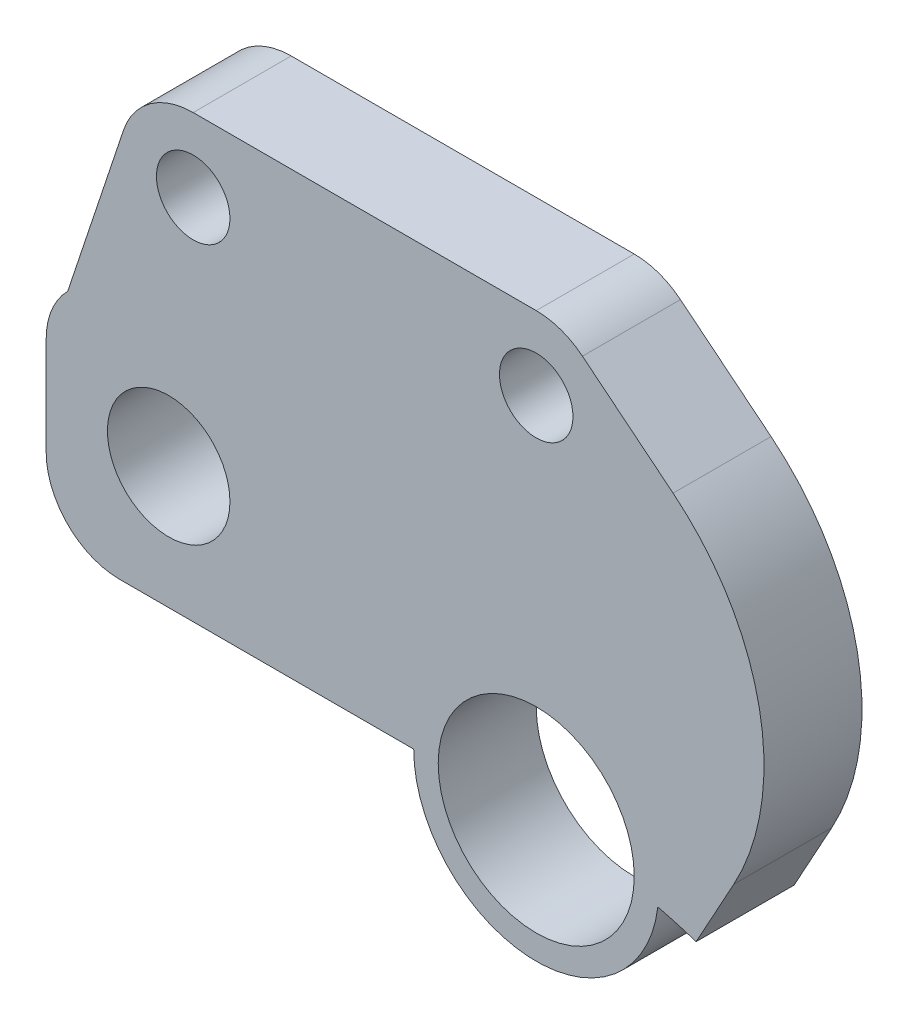
ISO-10303-21;
HEADER;
FILE_DESCRIPTION(('STEP AP214'),'2;1');
FILE_NAME('part.step','',(''),(''),'','','');
FILE_SCHEMA(('AUTOMOTIVE_DESIGN { 1 0 10303 214 1 1 1 1 }'));
ENDSEC;
DATA;
#1=APPLICATION_CONTEXT('core data for automotive mechanical design processes');
#2=APPLICATION_PROTOCOL_DEFINITION('international standard','automotive_design',2000,#1);
#3=PRODUCT_CONTEXT('',#1,'mechanical');
#4=PRODUCT('Part','Part','',(#3));
#5=PRODUCT_RELATED_PRODUCT_CATEGORY('part','',(#4));
#6=PRODUCT_DEFINITION_FORMATION('','',#4);
#7=PRODUCT_DEFINITION_CONTEXT('part definition',#1,'design');
#8=PRODUCT_DEFINITION('design','',#6,#7);
#9=PRODUCT_DEFINITION_SHAPE('','',#8);
#10=(LENGTH_UNIT() NAMED_UNIT(*) SI_UNIT(.MILLI.,.METRE.));
#11=(NAMED_UNIT(*) PLANE_ANGLE_UNIT() SI_UNIT($,.RADIAN.));
#12=(NAMED_UNIT(*) SI_UNIT($,.STERADIAN.) SOLID_ANGLE_UNIT());
#13=UNCERTAINTY_MEASURE_WITH_UNIT(LENGTH_MEASURE(1.E-05),#10,'distance_accuracy_value','');
#14=(GEOMETRIC_REPRESENTATION_CONTEXT(3) GLOBAL_UNCERTAINTY_ASSIGNED_CONTEXT((#13)) GLOBAL_UNIT_ASSIGNED_CONTEXT((#10,
#11,#12)) REPRESENTATION_CONTEXT('',''));
#15=CARTESIAN_POINT('',(0.,0.,0.));
#16=DIRECTION('',(0.,0.,1.));
#17=DIRECTION('',(1.,0.,0.));
#18=AXIS2_PLACEMENT_3D('',#15,#16,#17);
#19=CARTESIAN_POINT('',(0.,0.,4.));
#20=DIRECTION('',(0.,0.,-1.));
#21=DIRECTION('',(-1.,0.,0.));
#22=AXIS2_PLACEMENT_3D('',#19,#20,#21);
#23=CYLINDRICAL_SURFACE('',#22,20.95);
#24=CARTESIAN_POINT('',(0.,0.,0.));
#25=DIRECTION('',(0.,0.,1.));
#26=DIRECTION('',(1.,0.,0.));
#27=AXIS2_PLACEMENT_3D('',#24,#25,#26);
#28=CIRCLE('',#27,20.95);
#29=CARTESIAN_POINT('',(6.52630372987979,19.90753273576,0.));
#30=VERTEX_POINT('',#29);
#31=CARTESIAN_POINT('',(4.96427219059639,20.3533412887828,0.));
#32=VERTEX_POINT('',#31);
#33=EDGE_CURVE('E144',#30,#32,#28,.T.);
#34=ORIENTED_EDGE('',*,*,#33,.F.);
#35=DIRECTION('',(0.,0.,1.));
#36=VECTOR('',#35,1.);
#37=CARTESIAN_POINT('',(6.52630372987979,19.90753273576,-6.));
#38=LINE('',#37,#36);
#39=CARTESIAN_POINT('',(6.52630372987979,19.90753273576,4.));
#40=VERTEX_POINT('',#39);
#41=EDGE_CURVE('E133',#30,#40,#38,.T.);
#42=ORIENTED_EDGE('',*,*,#41,.T.);
#43=CARTESIAN_POINT('',(0.,0.,4.));
#44=DIRECTION('',(0.,0.,1.));
#45=DIRECTION('',(1.,0.,0.));
#46=AXIS2_PLACEMENT_3D('',#43,#44,#45);
#47=CIRCLE('',#46,20.95);
#48=CARTESIAN_POINT('',(4.96427219059639,20.3533412887828,4.));
#49=VERTEX_POINT('',#48);
#50=EDGE_CURVE('E142',#40,#49,#47,.T.);
#51=ORIENTED_EDGE('',*,*,#50,.T.);
#52=DIRECTION('',(0.,0.,-1.));
#53=VECTOR('',#52,1.);
#54=CARTESIAN_POINT('',(4.96427219059639,20.3533412887828,4.));
#55=LINE('',#54,#53);
#56=EDGE_CURVE('E190',#49,#32,#55,.T.);
#57=ORIENTED_EDGE('',*,*,#56,.T.);
#58=EDGE_LOOP('',(#34,#42,#51,#57));
#59=FACE_BOUND('',#58,.T.);
#60=ADVANCED_FACE('F35',(#59),#23,.F.);
#61=CARTESIAN_POINT('',(19.4651242928461,24.0626564673157,4.));
#62=DIRECTION('',(0.628921624970796,0.777468706536857,0.));
#63=DIRECTION('',(-0.777468706536857,0.628921624970796,0.));
#64=AXIS2_PLACEMENT_3D('',#61,#62,#63);
#65=PLANE('',#64);
#66=DIRECTION('',(0.777468706536857,-0.628921624970796,0.));
#67=VECTOR('',#66,1.);
#68=CARTESIAN_POINT('',(19.4651242928461,24.0626564673157,4.));
#69=LINE('',#68,#67);
#70=CARTESIAN_POINT('',(1.88676487491238,38.2824061196106,4.));
#71=VERTEX_POINT('',#70);
#72=CARTESIAN_POINT('',(5.58539292199624,35.2904565504812,4.));
#73=VERTEX_POINT('',#72);
#74=EDGE_CURVE('E152',#71,#73,#69,.T.);
#75=ORIENTED_EDGE('',*,*,#74,.T.);
#76=DIRECTION('',(0.,0.,1.));
#77=VECTOR('',#76,1.);
#78=CARTESIAN_POINT('',(5.58539292199625,35.2904565504812,4.));
#79=LINE('',#78,#77);
#80=CARTESIAN_POINT('',(5.58539292199624,35.2904565504812,0.));
#81=VERTEX_POINT('',#80);
#82=EDGE_CURVE('E43',#73,#81,#79,.F.);
#83=ORIENTED_EDGE('',*,*,#82,.T.);
#84=DIRECTION('',(0.777468706536857,-0.628921624970796,0.));
#85=VECTOR('',#84,1.);
#86=CARTESIAN_POINT('',(19.4651242928461,24.0626564673157,0.));
#87=LINE('',#86,#85);
#88=CARTESIAN_POINT('',(1.88676487491238,38.2824061196106,0.));
#89=VERTEX_POINT('',#88);
#90=EDGE_CURVE('E197',#89,#81,#87,.T.);
#91=ORIENTED_EDGE('',*,*,#90,.F.);
#92=DIRECTION('',(0.,0.,-1.));
#93=VECTOR('',#92,1.);
#94=CARTESIAN_POINT('',(1.88676487491238,38.2824061196106,4.));
#95=LINE('',#94,#93);
#96=EDGE_CURVE('E251',#71,#89,#95,.T.);
#97=ORIENTED_EDGE('',*,*,#96,.F.);
#98=EDGE_LOOP('',(#75,#83,#91,#97));
#99=FACE_BOUND('',#98,.T.);
#100=ADVANCED_FACE('F261',(#99),#65,.T.);
#101=CARTESIAN_POINT('',(0.,0.,4.));
#102=DIRECTION('',(0.,0.,1.));
#103=DIRECTION('',(1.,0.,0.));
#104=AXIS2_PLACEMENT_3D('',#101,#102,#103);
#105=PLANE('',#104);
#106=CARTESIAN_POINT('',(-15.,25.95,4.));
#107=DIRECTION('',(0.,0.,1.));
#108=DIRECTION('',(1.,0.,0.));
#109=AXIS2_PLACEMENT_3D('',#106,#107,#108);
#110=CIRCLE('',#109,2.5);
#111=CARTESIAN_POINT('',(-12.5,25.95,4.));
#112=VERTEX_POINT('',#111);
#113=EDGE_CURVE('E158',#112,#112,#110,.T.);
#114=ORIENTED_EDGE('',*,*,#113,.F.);
#115=EDGE_LOOP('',(#114));
#116=FACE_BOUND('',#115,.T.);
#117=CARTESIAN_POINT('',(0.,20.95,4.));
#118=DIRECTION('',(0.,0.,1.));
#119=DIRECTION('',(1.,0.,0.));
#120=AXIS2_PLACEMENT_3D('',#117,#118,#119);
#121=CIRCLE('',#120,4.);
#122=CARTESIAN_POINT('',(4.,20.95,4.));
#123=VERTEX_POINT('',#122);
#124=EDGE_CURVE('E153',#123,#123,#121,.T.);
#125=ORIENTED_EDGE('',*,*,#124,.F.);
#126=EDGE_LOOP('',(#125));
#127=FACE_BOUND('',#126,.T.);
#128=CARTESIAN_POINT('',(-14.,35.95,4.));
#129=DIRECTION('',(0.,0.,1.));
#130=DIRECTION('',(1.,0.,0.));
#131=AXIS2_PLACEMENT_3D('',#128,#129,#130);
#132=CIRCLE('',#131,1.5);
#133=CARTESIAN_POINT('',(-12.5,35.95,4.));
#134=VERTEX_POINT('',#133);
#135=EDGE_CURVE('E184',#134,#134,#132,.T.);
#136=ORIENTED_EDGE('',*,*,#135,.F.);
#137=EDGE_LOOP('',(#136));
#138=FACE_BOUND('',#137,.T.);
#139=CARTESIAN_POINT('',(0.,35.95,4.));
#140=DIRECTION('',(0.,0.,1.));
#141=DIRECTION('',(1.,0.,0.));
#142=AXIS2_PLACEMENT_3D('',#139,#140,#141);
#143=CIRCLE('',#142,1.5);
#144=CARTESIAN_POINT('',(1.5,35.95,4.));
#145=VERTEX_POINT('',#144);
#146=EDGE_CURVE('E187',#145,#145,#143,.T.);
#147=ORIENTED_EDGE('',*,*,#146,.F.);
#148=EDGE_LOOP('',(#147));
#149=FACE_BOUND('',#148,.T.);
#150=DIRECTION('',(0.481449788710893,0.876473673848928,0.));
#151=VECTOR('',#150,1.);
#152=CARTESIAN_POINT('',(-3.38699580250888,1.86048761318945,4.));
#153=LINE('',#152,#151);
#154=CARTESIAN_POINT('',(8.06091341077757,22.7012715980037,4.));
#155=VERTEX_POINT('',#154);
#156=EDGE_CURVE('E129',#40,#155,#153,.T.);
#157=ORIENTED_EDGE('',*,*,#156,.T.);
#158=CARTESIAN_POINT('',(-0.703823327711713,27.5157694851126,4.));
#159=DIRECTION('',(0.,0.,1.));
#160=DIRECTION('',(1.,0.,0.));
#161=AXIS2_PLACEMENT_3D('',#158,#159,#160);
#162=CIRCLE('',#161,10.);
#163=EDGE_CURVE('E57',#155,#73,#162,.T.);
#164=ORIENTED_EDGE('',*,*,#163,.T.);
#165=ORIENTED_EDGE('',*,*,#74,.F.);
#166=CARTESIAN_POINT('',(0.,35.95,4.));
#167=DIRECTION('',(0.,0.,1.));
#168=DIRECTION('',(1.,0.,0.));
#169=AXIS2_PLACEMENT_3D('',#166,#167,#168);
#170=CIRCLE('',#169,3.);
#171=CARTESIAN_POINT('',(0.,38.95,4.));
#172=VERTEX_POINT('',#171);
#173=EDGE_CURVE('E155',#71,#172,#170,.T.);
#174=ORIENTED_EDGE('',*,*,#173,.T.);
#175=DIRECTION('',(1.,0.,0.));
#176=VECTOR('',#175,1.);
#177=CARTESIAN_POINT('',(0.,38.95,4.));
#178=LINE('',#177,#176);
#179=CARTESIAN_POINT('',(-14.,38.95,4.));
#180=VERTEX_POINT('',#179);
#181=EDGE_CURVE('E163',#180,#172,#178,.T.);
#182=ORIENTED_EDGE('',*,*,#181,.F.);
#183=CARTESIAN_POINT('',(-14.,35.95,4.));
#184=DIRECTION('',(0.,0.,1.));
#185=DIRECTION('',(1.,0.,0.));
#186=AXIS2_PLACEMENT_3D('',#183,#184,#185);
#187=CIRCLE('',#186,3.);
#188=CARTESIAN_POINT('',(-16.846114570079,36.8984892482173,4.));
#189=VERTEX_POINT('',#188);
#190=EDGE_CURVE('E166',#180,#189,#187,.T.);
#191=ORIENTED_EDGE('',*,*,#190,.T.);
#192=DIRECTION('',(-0.316163082739092,-0.948704856693015,0.));
#193=VECTOR('',#192,1.);
#194=CARTESIAN_POINT('',(-26.2297262447128,8.7412550388306,4.));
#195=LINE('',#194,#193);
#196=CARTESIAN_POINT('',(-19.1213203435596,30.0713203435596,4.));
#197=VERTEX_POINT('',#196);
#198=EDGE_CURVE('E169',#189,#197,#195,.T.);
#199=ORIENTED_EDGE('',*,*,#198,.T.);
#200=CARTESIAN_POINT('',(-17.,27.95,4.));
#201=DIRECTION('',(0.,0.,1.));
#202=DIRECTION('',(1.,0.,0.));
#203=AXIS2_PLACEMENT_3D('',#200,#201,#202);
#204=CIRCLE('',#203,3.);
#205=CARTESIAN_POINT('',(-20.,27.95,4.));
#206=VERTEX_POINT('',#205);
#207=EDGE_CURVE('E172',#197,#206,#204,.T.);
#208=ORIENTED_EDGE('',*,*,#207,.T.);
#209=DIRECTION('',(0.,1.,0.));
#210=VECTOR('',#209,1.);
#211=CARTESIAN_POINT('',(-20.,0.,4.));
#212=LINE('',#211,#210);
#213=CARTESIAN_POINT('',(-20.,23.95,4.));
#214=VERTEX_POINT('',#213);
#215=EDGE_CURVE('E174',#214,#206,#212,.T.);
#216=ORIENTED_EDGE('',*,*,#215,.F.);
#217=CARTESIAN_POINT('',(-17.,23.95,4.));
#218=DIRECTION('',(0.,0.,1.));
#219=DIRECTION('',(1.,0.,0.));
#220=AXIS2_PLACEMENT_3D('',#217,#218,#219);
#221=CIRCLE('',#220,3.);
#222=CARTESIAN_POINT('',(-17.,20.95,4.));
#223=VERTEX_POINT('',#222);
#224=EDGE_CURVE('E177',#223,#214,#221,.F.);
#225=ORIENTED_EDGE('',*,*,#224,.F.);
#226=DIRECTION('',(-1.,0.,0.));
#227=VECTOR('',#226,1.);
#228=CARTESIAN_POINT('',(0.,20.95,4.));
#229=LINE('',#228,#227);
#230=CARTESIAN_POINT('',(-5.,20.95,4.));
#231=VERTEX_POINT('',#230);
#232=EDGE_CURVE('E180',#231,#223,#229,.T.);
#233=ORIENTED_EDGE('',*,*,#232,.F.);
#234=CARTESIAN_POINT('',(0.,20.95,4.));
#235=DIRECTION('',(0.,0.,1.));
#236=DIRECTION('',(1.,0.,0.));
#237=AXIS2_PLACEMENT_3D('',#234,#235,#236);
#238=CIRCLE('',#237,5.);
#239=EDGE_CURVE('E150',#231,#49,#238,.T.);
#240=ORIENTED_EDGE('',*,*,#239,.T.);
#241=ORIENTED_EDGE('',*,*,#50,.F.);
#242=EDGE_LOOP('',(#157,#164,#165,#174,#182,#191,#199,#208,#216,#225,#233,#240,#241));
#243=FACE_BOUND('',#242,.T.);
#244=ADVANCED_FACE('F147',(#116,#127,#138,#149,#243),#105,.T.);
#245=CARTESIAN_POINT('',(0.,0.,0.));
#246=DIRECTION('',(0.,0.,1.));
#247=DIRECTION('',(1.,0.,0.));
#248=AXIS2_PLACEMENT_3D('',#245,#246,#247);
#249=PLANE('',#248);
#250=CARTESIAN_POINT('',(0.,35.95,0.));
#251=DIRECTION('',(0.,0.,1.));
#252=DIRECTION('',(1.,0.,0.));
#253=AXIS2_PLACEMENT_3D('',#250,#251,#252);
#254=CIRCLE('',#253,1.5);
#255=CARTESIAN_POINT('',(1.5,35.95,0.));
#256=VERTEX_POINT('',#255);
#257=EDGE_CURVE('E229',#256,#256,#254,.T.);
#258=ORIENTED_EDGE('',*,*,#257,.T.);
#259=EDGE_LOOP('',(#258));
#260=FACE_BOUND('',#259,.T.);
#261=CARTESIAN_POINT('',(-14.,35.95,0.));
#262=DIRECTION('',(0.,0.,1.));
#263=DIRECTION('',(1.,0.,0.));
#264=AXIS2_PLACEMENT_3D('',#261,#262,#263);
#265=CIRCLE('',#264,1.5);
#266=CARTESIAN_POINT('',(-12.5,35.95,0.));
#267=VERTEX_POINT('',#266);
#268=EDGE_CURVE('E226',#267,#267,#265,.T.);
#269=ORIENTED_EDGE('',*,*,#268,.T.);
#270=EDGE_LOOP('',(#269));
#271=FACE_BOUND('',#270,.T.);
#272=CARTESIAN_POINT('',(0.,20.95,0.));
#273=DIRECTION('',(0.,0.,1.));
#274=DIRECTION('',(1.,0.,0.));
#275=AXIS2_PLACEMENT_3D('',#272,#273,#274);
#276=CIRCLE('',#275,4.);
#277=CARTESIAN_POINT('',(4.,20.95,0.));
#278=VERTEX_POINT('',#277);
#279=EDGE_CURVE('E193',#278,#278,#276,.T.);
#280=ORIENTED_EDGE('',*,*,#279,.T.);
#281=EDGE_LOOP('',(#280));
#282=FACE_BOUND('',#281,.T.);
#283=CARTESIAN_POINT('',(-15.,25.95,0.));
#284=DIRECTION('',(0.,0.,1.));
#285=DIRECTION('',(1.,0.,0.));
#286=AXIS2_PLACEMENT_3D('',#283,#284,#285);
#287=CIRCLE('',#286,2.5);
#288=CARTESIAN_POINT('',(-12.5,25.95,0.));
#289=VERTEX_POINT('',#288);
#290=EDGE_CURVE('E145',#289,#289,#287,.T.);
#291=ORIENTED_EDGE('',*,*,#290,.T.);
#292=EDGE_LOOP('',(#291));
#293=FACE_BOUND('',#292,.T.);
#294=ORIENTED_EDGE('',*,*,#90,.T.);
#295=CARTESIAN_POINT('',(-0.703823327711713,27.5157694851126,0.));
#296=DIRECTION('',(0.,0.,1.));
#297=DIRECTION('',(1.,0.,0.));
#298=AXIS2_PLACEMENT_3D('',#295,#296,#297);
#299=CIRCLE('',#298,10.);
#300=CARTESIAN_POINT('',(8.06091341077757,22.7012715980037,0.));
#301=VERTEX_POINT('',#300);
#302=EDGE_CURVE('E11',#81,#301,#299,.F.);
#303=ORIENTED_EDGE('',*,*,#302,.T.);
#304=DIRECTION('',(0.481449788710893,0.876473673848928,0.));
#305=VECTOR('',#304,1.);
#306=CARTESIAN_POINT('',(-3.38699580250888,1.86048761318945,0.));
#307=LINE('',#306,#305);
#308=EDGE_CURVE('E253',#30,#301,#307,.T.);
#309=ORIENTED_EDGE('',*,*,#308,.F.);
#310=ORIENTED_EDGE('',*,*,#33,.T.);
#311=CARTESIAN_POINT('',(0.,20.95,0.));
#312=DIRECTION('',(0.,0.,1.));
#313=DIRECTION('',(1.,0.,0.));
#314=AXIS2_PLACEMENT_3D('',#311,#312,#313);
#315=CIRCLE('',#314,5.);
#316=CARTESIAN_POINT('',(-5.,20.95,0.));
#317=VERTEX_POINT('',#316);
#318=EDGE_CURVE('E223',#317,#32,#315,.T.);
#319=ORIENTED_EDGE('',*,*,#318,.F.);
#320=DIRECTION('',(-1.,0.,0.));
#321=VECTOR('',#320,1.);
#322=CARTESIAN_POINT('',(0.,20.95,0.));
#323=LINE('',#322,#321);
#324=CARTESIAN_POINT('',(-17.,20.95,0.));
#325=VERTEX_POINT('',#324);
#326=EDGE_CURVE('E220',#317,#325,#323,.T.);
#327=ORIENTED_EDGE('',*,*,#326,.T.);
#328=CARTESIAN_POINT('',(-17.,23.95,0.));
#329=DIRECTION('',(0.,0.,1.));
#330=DIRECTION('',(1.,0.,0.));
#331=AXIS2_PLACEMENT_3D('',#328,#329,#330);
#332=CIRCLE('',#331,3.);
#333=CARTESIAN_POINT('',(-20.,23.95,0.));
#334=VERTEX_POINT('',#333);
#335=EDGE_CURVE('E217',#325,#334,#332,.F.);
#336=ORIENTED_EDGE('',*,*,#335,.T.);
#337=DIRECTION('',(0.,1.,0.));
#338=VECTOR('',#337,1.);
#339=CARTESIAN_POINT('',(-20.,0.,0.));
#340=LINE('',#339,#338);
#341=CARTESIAN_POINT('',(-20.,27.95,0.));
#342=VERTEX_POINT('',#341);
#343=EDGE_CURVE('E214',#334,#342,#340,.T.);
#344=ORIENTED_EDGE('',*,*,#343,.T.);
#345=CARTESIAN_POINT('',(-17.,27.95,0.));
#346=DIRECTION('',(0.,0.,1.));
#347=DIRECTION('',(1.,0.,0.));
#348=AXIS2_PLACEMENT_3D('',#345,#346,#347);
#349=CIRCLE('',#348,3.);
#350=CARTESIAN_POINT('',(-19.1213203435596,30.0713203435596,0.));
#351=VERTEX_POINT('',#350);
#352=EDGE_CURVE('E211',#351,#342,#349,.T.);
#353=ORIENTED_EDGE('',*,*,#352,.F.);
#354=DIRECTION('',(-0.316163082739092,-0.948704856693015,0.));
#355=VECTOR('',#354,1.);
#356=CARTESIAN_POINT('',(-26.2297262447128,8.7412550388306,0.));
#357=LINE('',#356,#355);
#358=CARTESIAN_POINT('',(-16.846114570079,36.8984892482173,0.));
#359=VERTEX_POINT('',#358);
#360=EDGE_CURVE('E208',#359,#351,#357,.T.);
#361=ORIENTED_EDGE('',*,*,#360,.F.);
#362=CARTESIAN_POINT('',(-14.,35.95,0.));
#363=DIRECTION('',(0.,0.,1.));
#364=DIRECTION('',(1.,0.,0.));
#365=AXIS2_PLACEMENT_3D('',#362,#363,#364);
#366=CIRCLE('',#365,3.);
#367=CARTESIAN_POINT('',(-14.,38.95,0.));
#368=VERTEX_POINT('',#367);
#369=EDGE_CURVE('E205',#368,#359,#366,.T.);
#370=ORIENTED_EDGE('',*,*,#369,.F.);
#371=DIRECTION('',(1.,0.,0.));
#372=VECTOR('',#371,1.);
#373=CARTESIAN_POINT('',(0.,38.95,0.));
#374=LINE('',#373,#372);
#375=CARTESIAN_POINT('',(0.,38.95,0.));
#376=VERTEX_POINT('',#375);
#377=EDGE_CURVE('E202',#368,#376,#374,.T.);
#378=ORIENTED_EDGE('',*,*,#377,.T.);
#379=CARTESIAN_POINT('',(0.,35.95,0.));
#380=DIRECTION('',(0.,0.,1.));
#381=DIRECTION('',(1.,0.,0.));
#382=AXIS2_PLACEMENT_3D('',#379,#380,#381);
#383=CIRCLE('',#382,3.);
#384=EDGE_CURVE('E199',#89,#376,#383,.T.);
#385=ORIENTED_EDGE('',*,*,#384,.F.);
#386=EDGE_LOOP('',(#294,#303,#309,#310,#319,#327,#336,#344,#353,#361,#370,#378,#385));
#387=FACE_BOUND('',#386,.T.);
#388=ADVANCED_FACE('F259',(#260,#271,#282,#293,#387),#249,.F.);
#389=CARTESIAN_POINT('',(0.,35.95,4.));
#390=DIRECTION('',(0.,0.,-1.));
#391=DIRECTION('',(-1.,0.,0.));
#392=AXIS2_PLACEMENT_3D('',#389,#390,#391);
#393=CYLINDRICAL_SURFACE('',#392,3.);
#394=ORIENTED_EDGE('',*,*,#384,.T.);
#395=DIRECTION('',(0.,0.,-1.));
#396=VECTOR('',#395,1.);
#397=CARTESIAN_POINT('',(0.,38.95,4.));
#398=LINE('',#397,#396);
#399=EDGE_CURVE('E249',#172,#376,#398,.T.);
#400=ORIENTED_EDGE('',*,*,#399,.F.);
#401=ORIENTED_EDGE('',*,*,#173,.F.);
#402=ORIENTED_EDGE('',*,*,#96,.T.);
#403=EDGE_LOOP('',(#394,#400,#401,#402));
#404=FACE_BOUND('',#403,.T.);
#405=ADVANCED_FACE('F265',(#404),#393,.T.);
#406=CARTESIAN_POINT('',(0.,38.95,4.));
#407=DIRECTION('',(0.,1.,0.));
#408=DIRECTION('',(0.,0.,1.));
#409=AXIS2_PLACEMENT_3D('',#406,#407,#408);
#410=PLANE('',#409);
#411=ORIENTED_EDGE('',*,*,#377,.F.);
#412=DIRECTION('',(0.,0.,-1.));
#413=VECTOR('',#412,1.);
#414=CARTESIAN_POINT('',(-14.,38.95,4.));
#415=LINE('',#414,#413);
#416=EDGE_CURVE('E247',#180,#368,#415,.T.);
#417=ORIENTED_EDGE('',*,*,#416,.F.);
#418=ORIENTED_EDGE('',*,*,#181,.T.);
#419=ORIENTED_EDGE('',*,*,#399,.T.);
#420=EDGE_LOOP('',(#411,#417,#418,#419));
#421=FACE_BOUND('',#420,.T.);
#422=ADVANCED_FACE('F271',(#421),#410,.T.);
#423=CARTESIAN_POINT('',(-14.,35.95,4.));
#424=DIRECTION('',(0.,0.,-1.));
#425=DIRECTION('',(-1.,0.,0.));
#426=AXIS2_PLACEMENT_3D('',#423,#424,#425);
#427=CYLINDRICAL_SURFACE('',#426,3.);
#428=ORIENTED_EDGE('',*,*,#369,.T.);
#429=DIRECTION('',(0.,0.,-1.));
#430=VECTOR('',#429,1.);
#431=CARTESIAN_POINT('',(-16.846114570079,36.8984892482173,4.));
#432=LINE('',#431,#430);
#433=EDGE_CURVE('E244',#189,#359,#432,.T.);
#434=ORIENTED_EDGE('',*,*,#433,.F.);
#435=ORIENTED_EDGE('',*,*,#190,.F.);
#436=ORIENTED_EDGE('',*,*,#416,.T.);
#437=EDGE_LOOP('',(#428,#434,#435,#436));
#438=FACE_BOUND('',#437,.T.);
#439=ADVANCED_FACE('F274',(#438),#427,.T.);
#440=CARTESIAN_POINT('',(-26.2297262447128,8.7412550388306,4.));
#441=DIRECTION('',(0.948704856693015,-0.316163082739092,0.));
#442=DIRECTION('',(0.316163082739092,0.948704856693015,0.));
#443=AXIS2_PLACEMENT_3D('',#440,#441,#442);
#444=PLANE('',#443);
#445=ORIENTED_EDGE('',*,*,#360,.T.);
#446=DIRECTION('',(0.,0.,-1.));
#447=VECTOR('',#446,1.);
#448=CARTESIAN_POINT('',(-19.1213203435596,30.0713203435596,4.));
#449=LINE('',#448,#447);
#450=EDGE_CURVE('E241',#197,#351,#449,.T.);
#451=ORIENTED_EDGE('',*,*,#450,.F.);
#452=ORIENTED_EDGE('',*,*,#198,.F.);
#453=ORIENTED_EDGE('',*,*,#433,.T.);
#454=EDGE_LOOP('',(#445,#451,#452,#453));
#455=FACE_BOUND('',#454,.T.);
#456=ADVANCED_FACE('F276',(#455),#444,.F.);
#457=CARTESIAN_POINT('',(-17.,27.95,4.));
#458=DIRECTION('',(0.,0.,-1.));
#459=DIRECTION('',(-1.,0.,0.));
#460=AXIS2_PLACEMENT_3D('',#457,#458,#459);
#461=CYLINDRICAL_SURFACE('',#460,3.);
#462=ORIENTED_EDGE('',*,*,#352,.T.);
#463=DIRECTION('',(0.,0.,-1.));
#464=VECTOR('',#463,1.);
#465=CARTESIAN_POINT('',(-20.,27.95,4.));
#466=LINE('',#465,#464);
#467=EDGE_CURVE('E239',#206,#342,#466,.T.);
#468=ORIENTED_EDGE('',*,*,#467,.F.);
#469=ORIENTED_EDGE('',*,*,#207,.F.);
#470=ORIENTED_EDGE('',*,*,#450,.T.);
#471=EDGE_LOOP('',(#462,#468,#469,#470));
#472=FACE_BOUND('',#471,.T.);
#473=ADVANCED_FACE('F282',(#472),#461,.T.);
#474=CARTESIAN_POINT('',(-20.,0.,4.));
#475=DIRECTION('',(-1.,0.,0.));
#476=DIRECTION('',(0.,0.,1.));
#477=AXIS2_PLACEMENT_3D('',#474,#475,#476);
#478=PLANE('',#477);
#479=ORIENTED_EDGE('',*,*,#343,.F.);
#480=DIRECTION('',(0.,0.,-1.));
#481=VECTOR('',#480,1.);
#482=CARTESIAN_POINT('',(-20.,23.95,4.));
#483=LINE('',#482,#481);
#484=EDGE_CURVE('E237',#214,#334,#483,.T.);
#485=ORIENTED_EDGE('',*,*,#484,.F.);
#486=ORIENTED_EDGE('',*,*,#215,.T.);
#487=ORIENTED_EDGE('',*,*,#467,.T.);
#488=EDGE_LOOP('',(#479,#485,#486,#487));
#489=FACE_BOUND('',#488,.T.);
#490=ADVANCED_FACE('F285',(#489),#478,.T.);
#491=CARTESIAN_POINT('',(-17.,23.95,4.));
#492=DIRECTION('',(0.,0.,-1.));
#493=DIRECTION('',(-1.,0.,0.));
#494=AXIS2_PLACEMENT_3D('',#491,#492,#493);
#495=CYLINDRICAL_SURFACE('',#494,3.);
#496=ORIENTED_EDGE('',*,*,#335,.F.);
#497=DIRECTION('',(0.,0.,-1.));
#498=VECTOR('',#497,1.);
#499=CARTESIAN_POINT('',(-17.,20.95,4.));
#500=LINE('',#499,#498);
#501=EDGE_CURVE('E235',#223,#325,#500,.T.);
#502=ORIENTED_EDGE('',*,*,#501,.F.);
#503=ORIENTED_EDGE('',*,*,#224,.T.);
#504=ORIENTED_EDGE('',*,*,#484,.T.);
#505=EDGE_LOOP('',(#496,#502,#503,#504));
#506=FACE_BOUND('',#505,.T.);
#507=ADVANCED_FACE('F288',(#506),#495,.T.);
#508=CARTESIAN_POINT('',(0.,20.95,4.));
#509=DIRECTION('',(0.,-1.,0.));
#510=DIRECTION('',(1.,0.,0.));
#511=AXIS2_PLACEMENT_3D('',#508,#509,#510);
#512=PLANE('',#511);
#513=ORIENTED_EDGE('',*,*,#326,.F.);
#514=DIRECTION('',(0.,0.,-1.));
#515=VECTOR('',#514,1.);
#516=CARTESIAN_POINT('',(-5.,20.95,4.));
#517=LINE('',#516,#515);
#518=EDGE_CURVE('E233',#231,#317,#517,.T.);
#519=ORIENTED_EDGE('',*,*,#518,.F.);
#520=ORIENTED_EDGE('',*,*,#232,.T.);
#521=ORIENTED_EDGE('',*,*,#501,.T.);
#522=EDGE_LOOP('',(#513,#519,#520,#521));
#523=FACE_BOUND('',#522,.T.);
#524=ADVANCED_FACE('F291',(#523),#512,.T.);
#525=CARTESIAN_POINT('',(-14.,35.95,4.));
#526=DIRECTION('',(0.,0.,-1.));
#527=DIRECTION('',(-1.,0.,0.));
#528=AXIS2_PLACEMENT_3D('',#525,#526,#527);
#529=CYLINDRICAL_SURFACE('',#528,1.5);
#530=ORIENTED_EDGE('',*,*,#135,.T.);
#531=EDGE_LOOP('',(#530));
#532=FACE_BOUND('',#531,.T.);
#533=ORIENTED_EDGE('',*,*,#268,.F.);
#534=EDGE_LOOP('',(#533));
#535=FACE_BOUND('',#534,.T.);
#536=ADVANCED_FACE('F297',(#532,#535),#529,.F.);
#537=CARTESIAN_POINT('',(0.,20.95,4.));
#538=DIRECTION('',(0.,0.,-1.));
#539=DIRECTION('',(-1.,0.,0.));
#540=AXIS2_PLACEMENT_3D('',#537,#538,#539);
#541=CYLINDRICAL_SURFACE('',#540,5.);
#542=ORIENTED_EDGE('',*,*,#318,.T.);
#543=ORIENTED_EDGE('',*,*,#56,.F.);
#544=ORIENTED_EDGE('',*,*,#239,.F.);
#545=ORIENTED_EDGE('',*,*,#518,.T.);
#546=EDGE_LOOP('',(#542,#543,#544,#545));
#547=FACE_BOUND('',#546,.T.);
#548=ADVANCED_FACE('F294',(#547),#541,.T.);
#549=CARTESIAN_POINT('',(0.,20.95,4.));
#550=DIRECTION('',(0.,0.,-1.));
#551=DIRECTION('',(-1.,0.,0.));
#552=AXIS2_PLACEMENT_3D('',#549,#550,#551);
#553=CYLINDRICAL_SURFACE('',#552,4.);
#554=ORIENTED_EDGE('',*,*,#124,.T.);
#555=EDGE_LOOP('',(#554));
#556=FACE_BOUND('',#555,.T.);
#557=ORIENTED_EDGE('',*,*,#279,.F.);
#558=EDGE_LOOP('',(#557));
#559=FACE_BOUND('',#558,.T.);
#560=ADVANCED_FACE('F296',(#556,#559),#553,.F.);
#561=CARTESIAN_POINT('',(-15.,25.95,4.));
#562=DIRECTION('',(0.,0.,-1.));
#563=DIRECTION('',(-1.,0.,0.));
#564=AXIS2_PLACEMENT_3D('',#561,#562,#563);
#565=CYLINDRICAL_SURFACE('',#564,2.5);
#566=ORIENTED_EDGE('',*,*,#113,.T.);
#567=EDGE_LOOP('',(#566));
#568=FACE_BOUND('',#567,.T.);
#569=ORIENTED_EDGE('',*,*,#290,.F.);
#570=EDGE_LOOP('',(#569));
#571=FACE_BOUND('',#570,.T.);
#572=ADVANCED_FACE('F303',(#568,#571),#565,.F.);
#573=CARTESIAN_POINT('',(0.,35.95,4.));
#574=DIRECTION('',(0.,0.,-1.));
#575=DIRECTION('',(-1.,0.,0.));
#576=AXIS2_PLACEMENT_3D('',#573,#574,#575);
#577=CYLINDRICAL_SURFACE('',#576,1.5);
#578=ORIENTED_EDGE('',*,*,#146,.T.);
#579=EDGE_LOOP('',(#578));
#580=FACE_BOUND('',#579,.T.);
#581=ORIENTED_EDGE('',*,*,#257,.F.);
#582=EDGE_LOOP('',(#581));
#583=FACE_BOUND('',#582,.T.);
#584=ADVANCED_FACE('F318',(#580,#583),#577,.F.);
#585=CARTESIAN_POINT('',(-3.38699580250888,1.86048761318945,-6.));
#586=DIRECTION('',(0.876473673848928,-0.481449788710893,0.));
#587=DIRECTION('',(0.481449788710893,0.876473673848928,0.));
#588=AXIS2_PLACEMENT_3D('',#585,#586,#587);
#589=PLANE('',#588);
#590=ORIENTED_EDGE('',*,*,#308,.T.);
#591=DIRECTION('',(0.,0.,1.));
#592=VECTOR('',#591,1.);
#593=CARTESIAN_POINT('',(8.06091341077757,22.7012715980037,-6.));
#594=LINE('',#593,#592);
#595=EDGE_CURVE('E136',#301,#155,#594,.T.);
#596=ORIENTED_EDGE('',*,*,#595,.T.);
#597=ORIENTED_EDGE('',*,*,#156,.F.);
#598=ORIENTED_EDGE('',*,*,#41,.F.);
#599=EDGE_LOOP('',(#590,#596,#597,#598));
#600=FACE_BOUND('',#599,.T.);
#601=ADVANCED_FACE('F132',(#600),#589,.T.);
#602=CARTESIAN_POINT('',(-0.703823327711713,27.5157694851126,-6.));
#603=DIRECTION('',(0.,0.,1.));
#604=DIRECTION('',(1.,0.,0.));
#605=AXIS2_PLACEMENT_3D('',#602,#603,#604);
#606=CYLINDRICAL_SURFACE('',#605,10.);
#607=ORIENTED_EDGE('',*,*,#302,.F.);
#608=ORIENTED_EDGE('',*,*,#82,.F.);
#609=ORIENTED_EDGE('',*,*,#163,.F.);
#610=ORIENTED_EDGE('',*,*,#595,.F.);
#611=EDGE_LOOP('',(#607,#608,#609,#610));
#612=FACE_BOUND('',#611,.T.);
#613=ADVANCED_FACE('F37',(#612),#606,.T.);
#614=CLOSED_SHELL('',(#60,#100,#244,#388,#405,#422,#439,#456,#473,#490,#507,#524,#536,#548,#560,
#572,#584,#601,#613));
#615=MANIFOLD_SOLID_BREP('B2',#614);
#616=ADVANCED_BREP_SHAPE_REPRESENTATION('',(#18,#615),#14);
#617=SHAPE_DEFINITION_REPRESENTATION(#9,#616);
ENDSEC;
END-ISO-10303-21;
